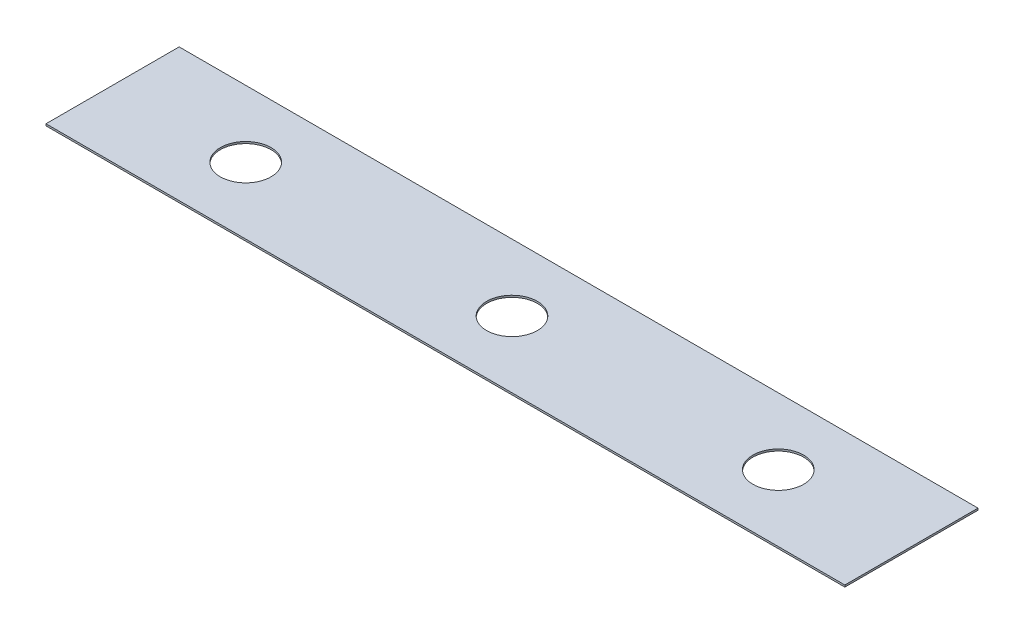
ISO-10303-21;
HEADER;
FILE_DESCRIPTION(('STEP AP214'),'2;1');
FILE_NAME('part.step','',(''),(''),'','','');
FILE_SCHEMA(('AUTOMOTIVE_DESIGN { 1 0 10303 214 1 1 1 1 }'));
ENDSEC;
DATA;
#1=APPLICATION_CONTEXT('core data for automotive mechanical design processes');
#2=APPLICATION_PROTOCOL_DEFINITION('international standard','automotive_design',2000,#1);
#3=PRODUCT_CONTEXT('',#1,'mechanical');
#4=PRODUCT('Part','Part','',(#3));
#5=PRODUCT_RELATED_PRODUCT_CATEGORY('part','',(#4));
#6=PRODUCT_DEFINITION_FORMATION('','',#4);
#7=PRODUCT_DEFINITION_CONTEXT('part definition',#1,'design');
#8=PRODUCT_DEFINITION('design','',#6,#7);
#9=PRODUCT_DEFINITION_SHAPE('','',#8);
#10=(LENGTH_UNIT() NAMED_UNIT(*) SI_UNIT(.MILLI.,.METRE.));
#11=(NAMED_UNIT(*) PLANE_ANGLE_UNIT() SI_UNIT($,.RADIAN.));
#12=(NAMED_UNIT(*) SI_UNIT($,.STERADIAN.) SOLID_ANGLE_UNIT());
#13=UNCERTAINTY_MEASURE_WITH_UNIT(LENGTH_MEASURE(1.E-05),#10,'distance_accuracy_value','');
#14=(GEOMETRIC_REPRESENTATION_CONTEXT(3) GLOBAL_UNCERTAINTY_ASSIGNED_CONTEXT((#13)) GLOBAL_UNIT_ASSIGNED_CONTEXT((#10,
#11,#12)) REPRESENTATION_CONTEXT('',''));
#15=CARTESIAN_POINT('',(0.,0.,0.));
#16=DIRECTION('',(0.,0.,1.));
#17=DIRECTION('',(1.,0.,0.));
#18=AXIS2_PLACEMENT_3D('',#15,#16,#17);
#19=CARTESIAN_POINT('',(38.1,0.1778,-6.35));
#20=DIRECTION('',(-1.,0.,0.));
#21=DIRECTION('',(0.,0.,1.));
#22=AXIS2_PLACEMENT_3D('',#19,#20,#21);
#23=PLANE('',#22);
#24=DIRECTION('',(0.,0.,-1.));
#25=VECTOR('',#24,1.);
#26=CARTESIAN_POINT('',(38.1,0.,-6.35));
#27=LINE('',#26,#25);
#28=CARTESIAN_POINT('',(38.1,0.,6.35));
#29=VERTEX_POINT('',#28);
#30=CARTESIAN_POINT('',(38.1,0.,-6.35));
#31=VERTEX_POINT('',#30);
#32=EDGE_CURVE('E96',#29,#31,#27,.T.);
#33=ORIENTED_EDGE('',*,*,#32,.T.);
#34=DIRECTION('',(0.,-1.,0.));
#35=VECTOR('',#34,1.);
#36=CARTESIAN_POINT('',(38.1,0.1778,-6.35));
#37=LINE('',#36,#35);
#38=CARTESIAN_POINT('',(38.1,0.1778,-6.35));
#39=VERTEX_POINT('',#38);
#40=EDGE_CURVE('E11',#39,#31,#37,.T.);
#41=ORIENTED_EDGE('',*,*,#40,.F.);
#42=DIRECTION('',(0.,0.,-1.));
#43=VECTOR('',#42,1.);
#44=CARTESIAN_POINT('',(38.1,0.1778,-6.35));
#45=LINE('',#44,#43);
#46=CARTESIAN_POINT('',(38.1,0.1778,6.35));
#47=VERTEX_POINT('',#46);
#48=EDGE_CURVE('E84',#47,#39,#45,.T.);
#49=ORIENTED_EDGE('',*,*,#48,.F.);
#50=DIRECTION('',(0.,-1.,0.));
#51=VECTOR('',#50,1.);
#52=CARTESIAN_POINT('',(38.1,0.1778,6.35));
#53=LINE('',#52,#51);
#54=EDGE_CURVE('E92',#47,#29,#53,.T.);
#55=ORIENTED_EDGE('',*,*,#54,.T.);
#56=EDGE_LOOP('',(#33,#41,#49,#55));
#57=FACE_BOUND('',#56,.T.);
#58=ADVANCED_FACE('F33',(#57),#23,.F.);
#59=CARTESIAN_POINT('',(-38.1,0.1778,-6.35));
#60=DIRECTION('',(0.,0.,1.));
#61=DIRECTION('',(1.,0.,0.));
#62=AXIS2_PLACEMENT_3D('',#59,#60,#61);
#63=PLANE('',#62);
#64=DIRECTION('',(-1.,0.,0.));
#65=VECTOR('',#64,1.);
#66=CARTESIAN_POINT('',(-38.1,0.,-6.35));
#67=LINE('',#66,#65);
#68=CARTESIAN_POINT('',(-38.1,0.,-6.35));
#69=VERTEX_POINT('',#68);
#70=EDGE_CURVE('E88',#31,#69,#67,.T.);
#71=ORIENTED_EDGE('',*,*,#70,.T.);
#72=DIRECTION('',(0.,-1.,0.));
#73=VECTOR('',#72,1.);
#74=CARTESIAN_POINT('',(-38.1,0.1778,-6.35));
#75=LINE('',#74,#73);
#76=CARTESIAN_POINT('',(-38.1,0.1778,-6.35));
#77=VERTEX_POINT('',#76);
#78=EDGE_CURVE('E41',#77,#69,#75,.T.);
#79=ORIENTED_EDGE('',*,*,#78,.F.);
#80=DIRECTION('',(-1.,0.,0.));
#81=VECTOR('',#80,1.);
#82=CARTESIAN_POINT('',(-38.1,0.1778,-6.35));
#83=LINE('',#82,#81);
#84=EDGE_CURVE('E79',#39,#77,#83,.T.);
#85=ORIENTED_EDGE('',*,*,#84,.F.);
#86=ORIENTED_EDGE('',*,*,#40,.T.);
#87=EDGE_LOOP('',(#71,#79,#85,#86));
#88=FACE_BOUND('',#87,.T.);
#89=ADVANCED_FACE('F87',(#88),#63,.F.);
#90=CARTESIAN_POINT('',(-38.1,0.1778,-6.35));
#91=DIRECTION('',(1.,0.,0.));
#92=DIRECTION('',(0.,0.,-1.));
#93=AXIS2_PLACEMENT_3D('',#90,#91,#92);
#94=PLANE('',#93);
#95=DIRECTION('',(0.,0.,1.));
#96=VECTOR('',#95,1.);
#97=CARTESIAN_POINT('',(-38.1,0.,-6.35));
#98=LINE('',#97,#96);
#99=CARTESIAN_POINT('',(-38.1,0.,6.35));
#100=VERTEX_POINT('',#99);
#101=EDGE_CURVE('E66',#69,#100,#98,.T.);
#102=ORIENTED_EDGE('',*,*,#101,.T.);
#103=DIRECTION('',(0.,-1.,0.));
#104=VECTOR('',#103,1.);
#105=CARTESIAN_POINT('',(-38.1,0.1778,6.35));
#106=LINE('',#105,#104);
#107=CARTESIAN_POINT('',(-38.1,0.1778,6.35));
#108=VERTEX_POINT('',#107);
#109=EDGE_CURVE('E89',#108,#100,#106,.T.);
#110=ORIENTED_EDGE('',*,*,#109,.F.);
#111=DIRECTION('',(0.,0.,1.));
#112=VECTOR('',#111,1.);
#113=CARTESIAN_POINT('',(-38.1,0.1778,-6.35));
#114=LINE('',#113,#112);
#115=EDGE_CURVE('E82',#77,#108,#114,.T.);
#116=ORIENTED_EDGE('',*,*,#115,.F.);
#117=ORIENTED_EDGE('',*,*,#78,.T.);
#118=EDGE_LOOP('',(#102,#110,#116,#117));
#119=FACE_BOUND('',#118,.T.);
#120=ADVANCED_FACE('F90',(#119),#94,.F.);
#121=CARTESIAN_POINT('',(-38.1,0.1778,6.35));
#122=DIRECTION('',(0.,0.,-1.));
#123=DIRECTION('',(-1.,0.,0.));
#124=AXIS2_PLACEMENT_3D('',#121,#122,#123);
#125=PLANE('',#124);
#126=DIRECTION('',(1.,0.,0.));
#127=VECTOR('',#126,1.);
#128=CARTESIAN_POINT('',(-38.1,0.,6.35));
#129=LINE('',#128,#127);
#130=EDGE_CURVE('E72',#100,#29,#129,.T.);
#131=ORIENTED_EDGE('',*,*,#130,.T.);
#132=ORIENTED_EDGE('',*,*,#54,.F.);
#133=DIRECTION('',(1.,0.,0.));
#134=VECTOR('',#133,1.);
#135=CARTESIAN_POINT('',(-38.1,0.1778,6.35));
#136=LINE('',#135,#134);
#137=EDGE_CURVE('E49',#108,#47,#136,.T.);
#138=ORIENTED_EDGE('',*,*,#137,.F.);
#139=ORIENTED_EDGE('',*,*,#109,.T.);
#140=EDGE_LOOP('',(#131,#132,#138,#139));
#141=FACE_BOUND('',#140,.T.);
#142=ADVANCED_FACE('F104',(#141),#125,.F.);
#143=CARTESIAN_POINT('',(0.,0.1778,0.));
#144=DIRECTION('',(0.,1.,0.));
#145=DIRECTION('',(0.,0.,1.));
#146=AXIS2_PLACEMENT_3D('',#143,#144,#145);
#147=PLANE('',#146);
#148=CARTESIAN_POINT('',(25.4,0.1778,0.));
#149=DIRECTION('',(0.,1.,0.));
#150=DIRECTION('',(0.,0.,1.));
#151=AXIS2_PLACEMENT_3D('',#148,#149,#150);
#152=CIRCLE('',#151,2.41935);
#153=CARTESIAN_POINT('',(25.4,0.1778,2.41935));
#154=VERTEX_POINT('',#153);
#155=EDGE_CURVE('E122',#154,#154,#152,.T.);
#156=ORIENTED_EDGE('',*,*,#155,.F.);
#157=EDGE_LOOP('',(#156));
#158=FACE_BOUND('',#157,.T.);
#159=CARTESIAN_POINT('',(-25.4,0.1778,0.));
#160=DIRECTION('',(0.,1.,0.));
#161=DIRECTION('',(0.,0.,1.));
#162=AXIS2_PLACEMENT_3D('',#159,#160,#161);
#163=CIRCLE('',#162,2.41935);
#164=CARTESIAN_POINT('',(-25.4,0.1778,2.41935));
#165=VERTEX_POINT('',#164);
#166=EDGE_CURVE('E116',#165,#165,#163,.T.);
#167=ORIENTED_EDGE('',*,*,#166,.F.);
#168=EDGE_LOOP('',(#167));
#169=FACE_BOUND('',#168,.T.);
#170=CARTESIAN_POINT('',(0.,0.1778,0.));
#171=DIRECTION('',(0.,1.,0.));
#172=DIRECTION('',(0.,0.,1.));
#173=AXIS2_PLACEMENT_3D('',#170,#171,#172);
#174=CIRCLE('',#173,2.41935);
#175=CARTESIAN_POINT('',(0.,0.1778,2.41935));
#176=VERTEX_POINT('',#175);
#177=EDGE_CURVE('E110',#176,#176,#174,.T.);
#178=ORIENTED_EDGE('',*,*,#177,.F.);
#179=EDGE_LOOP('',(#178));
#180=FACE_BOUND('',#179,.T.);
#181=ORIENTED_EDGE('',*,*,#48,.T.);
#182=ORIENTED_EDGE('',*,*,#84,.T.);
#183=ORIENTED_EDGE('',*,*,#115,.T.);
#184=ORIENTED_EDGE('',*,*,#137,.T.);
#185=EDGE_LOOP('',(#181,#182,#183,#184));
#186=FACE_BOUND('',#185,.T.);
#187=ADVANCED_FACE('F80',(#158,#169,#180,#186),#147,.T.);
#188=CARTESIAN_POINT('',(0.,0.,0.));
#189=DIRECTION('',(0.,1.,0.));
#190=DIRECTION('',(0.,0.,1.));
#191=AXIS2_PLACEMENT_3D('',#188,#189,#190);
#192=PLANE('',#191);
#193=CARTESIAN_POINT('',(25.4,0.,0.));
#194=DIRECTION('',(0.,1.,0.));
#195=DIRECTION('',(0.,0.,1.));
#196=AXIS2_PLACEMENT_3D('',#193,#194,#195);
#197=CIRCLE('',#196,2.41935);
#198=CARTESIAN_POINT('',(25.4,0.,2.41935));
#199=VERTEX_POINT('',#198);
#200=EDGE_CURVE('E119',#199,#199,#197,.T.);
#201=ORIENTED_EDGE('',*,*,#200,.T.);
#202=EDGE_LOOP('',(#201));
#203=FACE_BOUND('',#202,.T.);
#204=CARTESIAN_POINT('',(-25.4,0.,0.));
#205=DIRECTION('',(0.,1.,0.));
#206=DIRECTION('',(0.,0.,1.));
#207=AXIS2_PLACEMENT_3D('',#204,#205,#206);
#208=CIRCLE('',#207,2.41935);
#209=CARTESIAN_POINT('',(-25.4,0.,2.41935));
#210=VERTEX_POINT('',#209);
#211=EDGE_CURVE('E113',#210,#210,#208,.T.);
#212=ORIENTED_EDGE('',*,*,#211,.T.);
#213=EDGE_LOOP('',(#212));
#214=FACE_BOUND('',#213,.T.);
#215=CARTESIAN_POINT('',(0.,0.,0.));
#216=DIRECTION('',(0.,1.,0.));
#217=DIRECTION('',(0.,0.,1.));
#218=AXIS2_PLACEMENT_3D('',#215,#216,#217);
#219=CIRCLE('',#218,2.41935);
#220=CARTESIAN_POINT('',(0.,0.,2.41935));
#221=VERTEX_POINT('',#220);
#222=EDGE_CURVE('E99',#221,#221,#219,.T.);
#223=ORIENTED_EDGE('',*,*,#222,.T.);
#224=EDGE_LOOP('',(#223));
#225=FACE_BOUND('',#224,.T.);
#226=ORIENTED_EDGE('',*,*,#32,.F.);
#227=ORIENTED_EDGE('',*,*,#130,.F.);
#228=ORIENTED_EDGE('',*,*,#101,.F.);
#229=ORIENTED_EDGE('',*,*,#70,.F.);
#230=EDGE_LOOP('',(#226,#227,#228,#229));
#231=FACE_BOUND('',#230,.T.);
#232=ADVANCED_FACE('F107',(#203,#214,#225,#231),#192,.F.);
#233=CARTESIAN_POINT('',(0.,0.,0.));
#234=DIRECTION('',(0.,1.,0.));
#235=DIRECTION('',(0.,0.,1.));
#236=AXIS2_PLACEMENT_3D('',#233,#234,#235);
#237=CYLINDRICAL_SURFACE('',#236,2.41935);
#238=ORIENTED_EDGE('',*,*,#222,.F.);
#239=EDGE_LOOP('',(#238));
#240=FACE_BOUND('',#239,.T.);
#241=ORIENTED_EDGE('',*,*,#177,.T.);
#242=EDGE_LOOP('',(#241));
#243=FACE_BOUND('',#242,.T.);
#244=ADVANCED_FACE('F144',(#240,#243),#237,.F.);
#245=CARTESIAN_POINT('',(-25.4,0.,0.));
#246=DIRECTION('',(0.,1.,0.));
#247=DIRECTION('',(0.,0.,1.));
#248=AXIS2_PLACEMENT_3D('',#245,#246,#247);
#249=CYLINDRICAL_SURFACE('',#248,2.41935);
#250=ORIENTED_EDGE('',*,*,#211,.F.);
#251=EDGE_LOOP('',(#250));
#252=FACE_BOUND('',#251,.T.);
#253=ORIENTED_EDGE('',*,*,#166,.T.);
#254=EDGE_LOOP('',(#253));
#255=FACE_BOUND('',#254,.T.);
#256=ADVANCED_FACE('F133',(#252,#255),#249,.F.);
#257=CARTESIAN_POINT('',(25.4,0.,0.));
#258=DIRECTION('',(0.,1.,0.));
#259=DIRECTION('',(0.,0.,1.));
#260=AXIS2_PLACEMENT_3D('',#257,#258,#259);
#261=CYLINDRICAL_SURFACE('',#260,2.41935);
#262=ORIENTED_EDGE('',*,*,#200,.F.);
#263=EDGE_LOOP('',(#262));
#264=FACE_BOUND('',#263,.T.);
#265=ORIENTED_EDGE('',*,*,#155,.T.);
#266=EDGE_LOOP('',(#265));
#267=FACE_BOUND('',#266,.T.);
#268=ADVANCED_FACE('F130',(#264,#267),#261,.F.);
#269=CLOSED_SHELL('',(#58,#89,#120,#142,#187,#232,#244,#256,#268));
#270=MANIFOLD_SOLID_BREP('B2',#269);
#271=ADVANCED_BREP_SHAPE_REPRESENTATION('',(#18,#270),#14);
#272=SHAPE_DEFINITION_REPRESENTATION(#9,#271);
ENDSEC;
END-ISO-10303-21;
